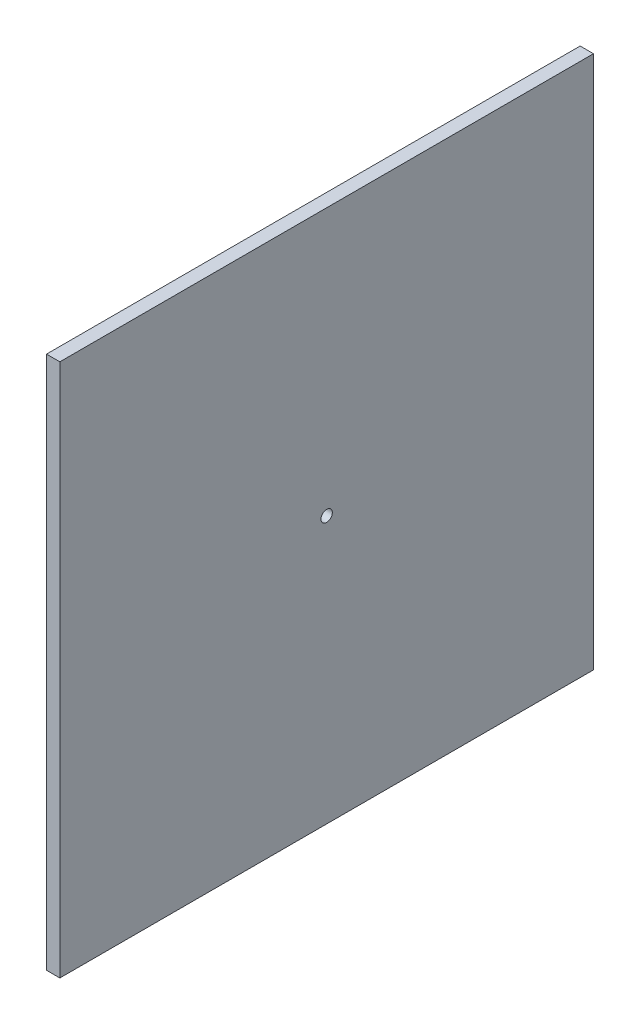
ISO-10303-21;
HEADER;
FILE_DESCRIPTION(('STEP AP214'),'2;1');
FILE_NAME('part.step','',(''),(''),'','','');
FILE_SCHEMA(('AUTOMOTIVE_DESIGN { 1 0 10303 214 1 1 1 1 }'));
ENDSEC;
DATA;
#1=APPLICATION_CONTEXT('core data for automotive mechanical design processes');
#2=APPLICATION_PROTOCOL_DEFINITION('international standard','automotive_design',2000,#1);
#3=PRODUCT_CONTEXT('',#1,'mechanical');
#4=PRODUCT('Part','Part','',(#3));
#5=PRODUCT_RELATED_PRODUCT_CATEGORY('part','',(#4));
#6=PRODUCT_DEFINITION_FORMATION('','',#4);
#7=PRODUCT_DEFINITION_CONTEXT('part definition',#1,'design');
#8=PRODUCT_DEFINITION('design','',#6,#7);
#9=PRODUCT_DEFINITION_SHAPE('','',#8);
#10=(LENGTH_UNIT() NAMED_UNIT(*) SI_UNIT(.MILLI.,.METRE.));
#11=(NAMED_UNIT(*) PLANE_ANGLE_UNIT() SI_UNIT($,.RADIAN.));
#12=(NAMED_UNIT(*) SI_UNIT($,.STERADIAN.) SOLID_ANGLE_UNIT());
#13=UNCERTAINTY_MEASURE_WITH_UNIT(LENGTH_MEASURE(1.E-05),#10,'distance_accuracy_value','');
#14=(GEOMETRIC_REPRESENTATION_CONTEXT(3) GLOBAL_UNCERTAINTY_ASSIGNED_CONTEXT((#13)) GLOBAL_UNIT_ASSIGNED_CONTEXT((#10,
#11,#12)) REPRESENTATION_CONTEXT('',''));
#15=CARTESIAN_POINT('',(0.,0.,0.));
#16=DIRECTION('',(0.,0.,1.));
#17=DIRECTION('',(1.,0.,0.));
#18=AXIS2_PLACEMENT_3D('',#15,#16,#17);
#19=CARTESIAN_POINT('',(10.,0.,0.));
#20=DIRECTION('',(-1.,0.,0.));
#21=DIRECTION('',(0.,0.,1.));
#22=AXIS2_PLACEMENT_3D('',#19,#20,#21);
#23=PLANE('',#22);
#24=DIRECTION('',(0.,1.,0.));
#25=VECTOR('',#24,1.);
#26=CARTESIAN_POINT('',(10.,-200.,-200.));
#27=LINE('',#26,#25);
#28=CARTESIAN_POINT('',(10.,-200.,-200.));
#29=VERTEX_POINT('',#28);
#30=CARTESIAN_POINT('',(10.,200.,-200.));
#31=VERTEX_POINT('',#30);
#32=EDGE_CURVE('E88',#29,#31,#27,.T.);
#33=ORIENTED_EDGE('',*,*,#32,.T.);
#34=DIRECTION('',(0.,0.,1.));
#35=VECTOR('',#34,1.);
#36=CARTESIAN_POINT('',(10.,200.,200.));
#37=LINE('',#36,#35);
#38=CARTESIAN_POINT('',(10.,200.,200.));
#39=VERTEX_POINT('',#38);
#40=EDGE_CURVE('E83',#31,#39,#37,.T.);
#41=ORIENTED_EDGE('',*,*,#40,.T.);
#42=DIRECTION('',(0.,-1.,0.));
#43=VECTOR('',#42,1.);
#44=CARTESIAN_POINT('',(10.,-200.,200.));
#45=LINE('',#44,#43);
#46=CARTESIAN_POINT('',(10.,-200.,200.));
#47=VERTEX_POINT('',#46);
#48=EDGE_CURVE('E86',#39,#47,#45,.T.);
#49=ORIENTED_EDGE('',*,*,#48,.T.);
#50=DIRECTION('',(0.,0.,-1.));
#51=VECTOR('',#50,1.);
#52=CARTESIAN_POINT('',(10.,-200.,200.));
#53=LINE('',#52,#51);
#54=EDGE_CURVE('E53',#47,#29,#53,.T.);
#55=ORIENTED_EDGE('',*,*,#54,.T.);
#56=EDGE_LOOP('',(#33,#41,#49,#55));
#57=FACE_BOUND('',#56,.T.);
#58=CARTESIAN_POINT('',(10.,0.,0.));
#59=DIRECTION('',(1.,0.,0.));
#60=DIRECTION('',(0.,0.,-1.));
#61=AXIS2_PLACEMENT_3D('',#58,#59,#60);
#62=CIRCLE('',#61,4.25);
#63=CARTESIAN_POINT('',(10.,0.,-4.24999999999997));
#64=VERTEX_POINT('',#63);
#65=EDGE_CURVE('E103',#64,#64,#62,.T.);
#66=ORIENTED_EDGE('',*,*,#65,.F.);
#67=EDGE_LOOP('',(#66));
#68=FACE_BOUND('',#67,.T.);
#69=ADVANCED_FACE('F36',(#57,#68),#23,.F.);
#70=CARTESIAN_POINT('',(0.,0.,0.));
#71=DIRECTION('',(-1.,0.,0.));
#72=DIRECTION('',(0.,0.,1.));
#73=AXIS2_PLACEMENT_3D('',#70,#71,#72);
#74=PLANE('',#73);
#75=DIRECTION('',(0.,1.,0.));
#76=VECTOR('',#75,1.);
#77=CARTESIAN_POINT('',(0.,-200.,-200.));
#78=LINE('',#77,#76);
#79=CARTESIAN_POINT('',(0.,-200.,-200.));
#80=VERTEX_POINT('',#79);
#81=CARTESIAN_POINT('',(0.,200.,-200.));
#82=VERTEX_POINT('',#81);
#83=EDGE_CURVE('E100',#80,#82,#78,.T.);
#84=ORIENTED_EDGE('',*,*,#83,.F.);
#85=DIRECTION('',(0.,0.,-1.));
#86=VECTOR('',#85,1.);
#87=CARTESIAN_POINT('',(0.,-200.,200.));
#88=LINE('',#87,#86);
#89=CARTESIAN_POINT('',(0.,-200.,200.));
#90=VERTEX_POINT('',#89);
#91=EDGE_CURVE('E76',#90,#80,#88,.T.);
#92=ORIENTED_EDGE('',*,*,#91,.F.);
#93=DIRECTION('',(0.,-1.,0.));
#94=VECTOR('',#93,1.);
#95=CARTESIAN_POINT('',(0.,-200.,200.));
#96=LINE('',#95,#94);
#97=CARTESIAN_POINT('',(0.,200.,200.));
#98=VERTEX_POINT('',#97);
#99=EDGE_CURVE('E70',#98,#90,#96,.T.);
#100=ORIENTED_EDGE('',*,*,#99,.F.);
#101=DIRECTION('',(0.,0.,1.));
#102=VECTOR('',#101,1.);
#103=CARTESIAN_POINT('',(0.,200.,200.));
#104=LINE('',#103,#102);
#105=EDGE_CURVE('E92',#82,#98,#104,.T.);
#106=ORIENTED_EDGE('',*,*,#105,.F.);
#107=EDGE_LOOP('',(#84,#92,#100,#106));
#108=FACE_BOUND('',#107,.T.);
#109=CARTESIAN_POINT('',(0.,0.,0.));
#110=DIRECTION('',(1.,0.,0.));
#111=DIRECTION('',(0.,0.,-1.));
#112=AXIS2_PLACEMENT_3D('',#109,#110,#111);
#113=CIRCLE('',#112,4.25);
#114=CARTESIAN_POINT('',(0.,0.,-4.24999999999997));
#115=VERTEX_POINT('',#114);
#116=EDGE_CURVE('E115',#115,#115,#113,.T.);
#117=ORIENTED_EDGE('',*,*,#116,.T.);
#118=EDGE_LOOP('',(#117));
#119=FACE_BOUND('',#118,.T.);
#120=ADVANCED_FACE('F111',(#108,#119),#74,.T.);
#121=CARTESIAN_POINT('',(10.,-200.,-200.));
#122=DIRECTION('',(0.,0.,1.));
#123=DIRECTION('',(1.,0.,0.));
#124=AXIS2_PLACEMENT_3D('',#121,#122,#123);
#125=PLANE('',#124);
#126=ORIENTED_EDGE('',*,*,#83,.T.);
#127=DIRECTION('',(-1.,0.,0.));
#128=VECTOR('',#127,1.);
#129=CARTESIAN_POINT('',(10.,200.,-200.));
#130=LINE('',#129,#128);
#131=EDGE_CURVE('E11',#31,#82,#130,.T.);
#132=ORIENTED_EDGE('',*,*,#131,.F.);
#133=ORIENTED_EDGE('',*,*,#32,.F.);
#134=DIRECTION('',(-1.,0.,0.));
#135=VECTOR('',#134,1.);
#136=CARTESIAN_POINT('',(10.,-200.,-200.));
#137=LINE('',#136,#135);
#138=EDGE_CURVE('E96',#29,#80,#137,.T.);
#139=ORIENTED_EDGE('',*,*,#138,.T.);
#140=EDGE_LOOP('',(#126,#132,#133,#139));
#141=FACE_BOUND('',#140,.T.);
#142=ADVANCED_FACE('F38',(#141),#125,.F.);
#143=CARTESIAN_POINT('',(10.,200.,200.));
#144=DIRECTION('',(0.,-1.,0.));
#145=DIRECTION('',(0.,0.,-1.));
#146=AXIS2_PLACEMENT_3D('',#143,#144,#145);
#147=PLANE('',#146);
#148=ORIENTED_EDGE('',*,*,#105,.T.);
#149=DIRECTION('',(-1.,0.,0.));
#150=VECTOR('',#149,1.);
#151=CARTESIAN_POINT('',(10.,200.,200.));
#152=LINE('',#151,#150);
#153=EDGE_CURVE('E45',#39,#98,#152,.T.);
#154=ORIENTED_EDGE('',*,*,#153,.F.);
#155=ORIENTED_EDGE('',*,*,#40,.F.);
#156=ORIENTED_EDGE('',*,*,#131,.T.);
#157=EDGE_LOOP('',(#148,#154,#155,#156));
#158=FACE_BOUND('',#157,.T.);
#159=ADVANCED_FACE('F91',(#158),#147,.F.);
#160=CARTESIAN_POINT('',(10.,-200.,200.));
#161=DIRECTION('',(0.,0.,-1.));
#162=DIRECTION('',(-1.,0.,0.));
#163=AXIS2_PLACEMENT_3D('',#160,#161,#162);
#164=PLANE('',#163);
#165=ORIENTED_EDGE('',*,*,#99,.T.);
#166=DIRECTION('',(-1.,0.,0.));
#167=VECTOR('',#166,1.);
#168=CARTESIAN_POINT('',(10.,-200.,200.));
#169=LINE('',#168,#167);
#170=EDGE_CURVE('E93',#47,#90,#169,.T.);
#171=ORIENTED_EDGE('',*,*,#170,.F.);
#172=ORIENTED_EDGE('',*,*,#48,.F.);
#173=ORIENTED_EDGE('',*,*,#153,.T.);
#174=EDGE_LOOP('',(#165,#171,#172,#173));
#175=FACE_BOUND('',#174,.T.);
#176=ADVANCED_FACE('F94',(#175),#164,.F.);
#177=CARTESIAN_POINT('',(10.,-200.,200.));
#178=DIRECTION('',(0.,1.,0.));
#179=DIRECTION('',(0.,0.,1.));
#180=AXIS2_PLACEMENT_3D('',#177,#178,#179);
#181=PLANE('',#180);
#182=ORIENTED_EDGE('',*,*,#91,.T.);
#183=ORIENTED_EDGE('',*,*,#138,.F.);
#184=ORIENTED_EDGE('',*,*,#54,.F.);
#185=ORIENTED_EDGE('',*,*,#170,.T.);
#186=EDGE_LOOP('',(#182,#183,#184,#185));
#187=FACE_BOUND('',#186,.T.);
#188=ADVANCED_FACE('F108',(#187),#181,.F.);
#189=CARTESIAN_POINT('',(10.,0.,0.));
#190=DIRECTION('',(-1.,0.,0.));
#191=DIRECTION('',(0.,0.,1.));
#192=AXIS2_PLACEMENT_3D('',#189,#190,#191);
#193=CYLINDRICAL_SURFACE('',#192,4.25);
#194=ORIENTED_EDGE('',*,*,#65,.T.);
#195=EDGE_LOOP('',(#194));
#196=FACE_BOUND('',#195,.T.);
#197=ORIENTED_EDGE('',*,*,#116,.F.);
#198=EDGE_LOOP('',(#197));
#199=FACE_BOUND('',#198,.T.);
#200=ADVANCED_FACE('F121',(#196,#199),#193,.F.);
#201=CLOSED_SHELL('',(#69,#120,#142,#159,#176,#188,#200));
#202=MANIFOLD_SOLID_BREP('B2',#201);
#203=ADVANCED_BREP_SHAPE_REPRESENTATION('',(#18,#202),#14);
#204=SHAPE_DEFINITION_REPRESENTATION(#9,#203);
ENDSEC;
END-ISO-10303-21;
